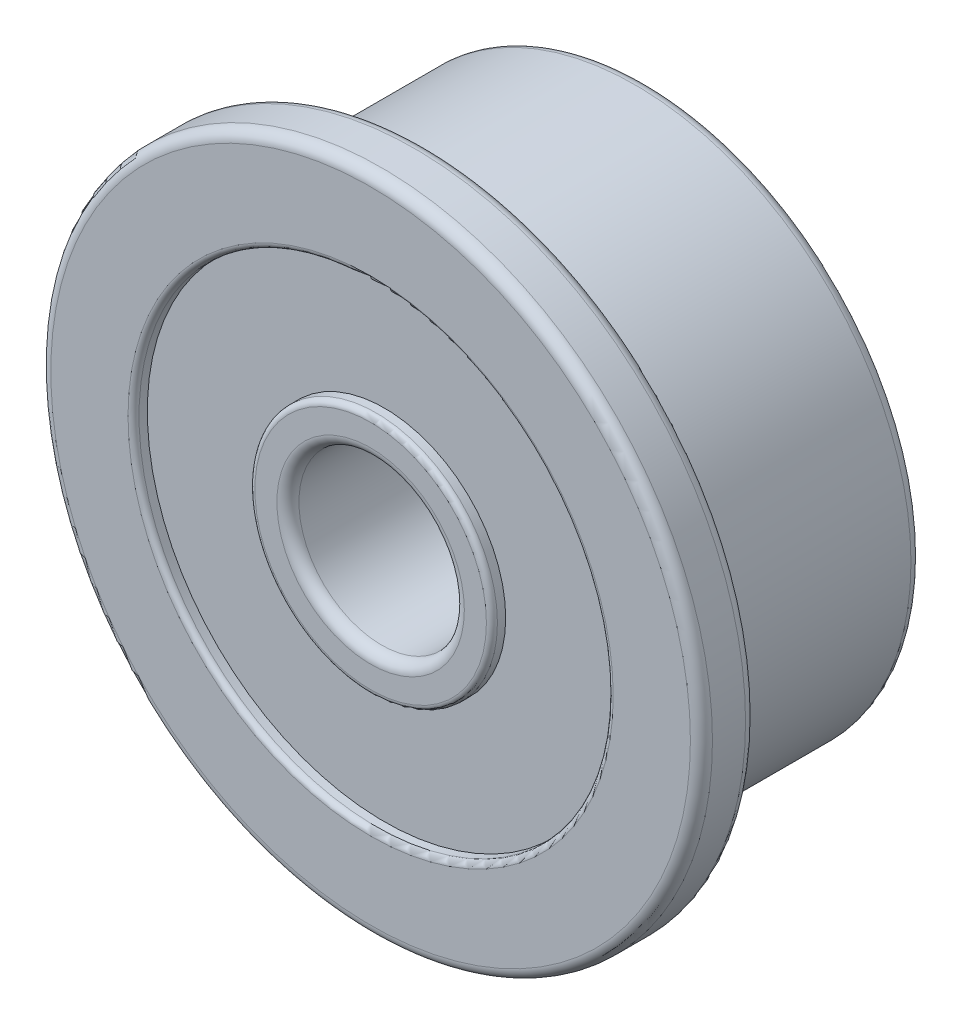
ISO-10303-21;
HEADER;
FILE_DESCRIPTION(('STEP AP214'),'2;1');
FILE_NAME('part.step','',(''),(''),'','','');
FILE_SCHEMA(('AUTOMOTIVE_DESIGN { 1 0 10303 214 1 1 1 1 }'));
ENDSEC;
DATA;
#1=APPLICATION_CONTEXT('core data for automotive mechanical design processes');
#2=APPLICATION_PROTOCOL_DEFINITION('international standard','automotive_design',2000,#1);
#3=PRODUCT_CONTEXT('',#1,'mechanical');
#4=PRODUCT('Part','Part','',(#3));
#5=PRODUCT_RELATED_PRODUCT_CATEGORY('part','',(#4));
#6=PRODUCT_DEFINITION_FORMATION('','',#4);
#7=PRODUCT_DEFINITION_CONTEXT('part definition',#1,'design');
#8=PRODUCT_DEFINITION('design','',#6,#7);
#9=PRODUCT_DEFINITION_SHAPE('','',#8);
#10=(LENGTH_UNIT() NAMED_UNIT(*) SI_UNIT(.MILLI.,.METRE.));
#11=(NAMED_UNIT(*) PLANE_ANGLE_UNIT() SI_UNIT($,.RADIAN.));
#12=(NAMED_UNIT(*) SI_UNIT($,.STERADIAN.) SOLID_ANGLE_UNIT());
#13=UNCERTAINTY_MEASURE_WITH_UNIT(LENGTH_MEASURE(1.E-05),#10,'distance_accuracy_value','');
#14=(GEOMETRIC_REPRESENTATION_CONTEXT(3) GLOBAL_UNCERTAINTY_ASSIGNED_CONTEXT((#13)) GLOBAL_UNIT_ASSIGNED_CONTEXT((#10,
#11,#12)) REPRESENTATION_CONTEXT('',''));
#15=CARTESIAN_POINT('',(0.,0.,0.));
#16=DIRECTION('',(0.,0.,1.));
#17=DIRECTION('',(1.,0.,0.));
#18=AXIS2_PLACEMENT_3D('',#15,#16,#17);
#19=CARTESIAN_POINT('',(0.,0.,5.));
#20=DIRECTION('',(0.,0.,1.));
#21=DIRECTION('',(1.,0.,0.));
#22=AXIS2_PLACEMENT_3D('',#19,#20,#21);
#23=PLANE('',#22);
#24=CARTESIAN_POINT('',(0.,0.,5.));
#25=DIRECTION('',(0.,0.,1.));
#26=DIRECTION('',(1.,0.,0.));
#27=AXIS2_PLACEMENT_3D('',#24,#25,#26);
#28=CIRCLE('',#27,2.1);
#29=CARTESIAN_POINT('',(2.1,0.,5.));
#30=VERTEX_POINT('',#29);
#31=EDGE_CURVE('E50',#30,#30,#28,.T.);
#32=ORIENTED_EDGE('',*,*,#31,.T.);
#33=EDGE_LOOP('',(#32));
#34=FACE_BOUND('',#33,.T.);
#35=CARTESIAN_POINT('',(0.,0.,5.));
#36=DIRECTION('',(0.,0.,1.));
#37=DIRECTION('',(1.,0.,0.));
#38=AXIS2_PLACEMENT_3D('',#35,#36,#37);
#39=CIRCLE('',#38,1.7);
#40=CARTESIAN_POINT('',(1.7,0.,5.));
#41=VERTEX_POINT('',#40);
#42=EDGE_CURVE('E85',#41,#41,#39,.F.);
#43=ORIENTED_EDGE('',*,*,#42,.T.);
#44=EDGE_LOOP('',(#43));
#45=FACE_BOUND('',#44,.T.);
#46=ADVANCED_FACE('F35',(#34,#45),#23,.T.);
#47=CARTESIAN_POINT('',(0.,0.,0.));
#48=DIRECTION('',(0.,0.,1.));
#49=DIRECTION('',(1.,0.,0.));
#50=AXIS2_PLACEMENT_3D('',#47,#48,#49);
#51=PLANE('',#50);
#52=CARTESIAN_POINT('',(0.,0.,0.));
#53=DIRECTION('',(0.,0.,1.));
#54=DIRECTION('',(1.,0.,0.));
#55=AXIS2_PLACEMENT_3D('',#52,#53,#54);
#56=CIRCLE('',#55,2.1);
#57=CARTESIAN_POINT('',(2.1,0.,0.));
#58=VERTEX_POINT('',#57);
#59=EDGE_CURVE('E58',#58,#58,#56,.F.);
#60=ORIENTED_EDGE('',*,*,#59,.T.);
#61=EDGE_LOOP('',(#60));
#62=FACE_BOUND('',#61,.T.);
#63=CARTESIAN_POINT('',(0.,0.,0.));
#64=DIRECTION('',(0.,0.,1.));
#65=DIRECTION('',(1.,0.,0.));
#66=AXIS2_PLACEMENT_3D('',#63,#64,#65);
#67=CIRCLE('',#66,1.7);
#68=CARTESIAN_POINT('',(1.7,0.,0.));
#69=VERTEX_POINT('',#68);
#70=EDGE_CURVE('E79',#69,#69,#67,.T.);
#71=ORIENTED_EDGE('',*,*,#70,.T.);
#72=EDGE_LOOP('',(#71));
#73=FACE_BOUND('',#72,.T.);
#74=ADVANCED_FACE('F135',(#62,#73),#51,.F.);
#75=CARTESIAN_POINT('',(0.,0.,0.));
#76=DIRECTION('',(0.,0.,1.));
#77=DIRECTION('',(1.,0.,0.));
#78=AXIS2_PLACEMENT_3D('',#75,#76,#77);
#79=CIRCLE('',#78,4.4);
#80=CARTESIAN_POINT('',(4.4,0.,0.));
#81=VERTEX_POINT('',#80);
#82=EDGE_CURVE('E61',#81,#81,#79,.T.);
#83=ORIENTED_EDGE('',*,*,#82,.T.);
#84=EDGE_LOOP('',(#83));
#85=FACE_BOUND('',#84,.T.);
#86=CARTESIAN_POINT('',(0.,0.,0.));
#87=DIRECTION('',(0.,0.,1.));
#88=DIRECTION('',(1.,0.,0.));
#89=AXIS2_PLACEMENT_3D('',#86,#87,#88);
#90=CIRCLE('',#89,4.8);
#91=CARTESIAN_POINT('',(4.8,0.,0.));
#92=VERTEX_POINT('',#91);
#93=EDGE_CURVE('E82',#92,#92,#90,.F.);
#94=ORIENTED_EDGE('',*,*,#93,.T.);
#95=EDGE_LOOP('',(#94));
#96=FACE_BOUND('',#95,.T.);
#97=ADVANCED_FACE('F142',(#85,#96),#51,.F.);
#98=CARTESIAN_POINT('',(0.,0.,4.));
#99=DIRECTION('',(0.,0.,-1.));
#100=DIRECTION('',(-1.,0.,0.));
#101=AXIS2_PLACEMENT_3D('',#98,#99,#100);
#102=CYLINDRICAL_SURFACE('',#101,5.);
#103=CARTESIAN_POINT('',(0.,0.,0.2));
#104=DIRECTION('',(0.,0.,1.));
#105=DIRECTION('',(1.,0.,0.));
#106=AXIS2_PLACEMENT_3D('',#103,#104,#105);
#107=CIRCLE('',#106,5.);
#108=CARTESIAN_POINT('',(5.,0.,0.2));
#109=VERTEX_POINT('',#108);
#110=EDGE_CURVE('E76',#109,#109,#107,.T.);
#111=ORIENTED_EDGE('',*,*,#110,.T.);
#112=EDGE_LOOP('',(#111));
#113=FACE_BOUND('',#112,.T.);
#114=CARTESIAN_POINT('',(0.,0.,4.));
#115=DIRECTION('',(0.,0.,1.));
#116=DIRECTION('',(1.,0.,0.));
#117=AXIS2_PLACEMENT_3D('',#114,#115,#116);
#118=CIRCLE('',#117,5.);
#119=CARTESIAN_POINT('',(5.,0.,4.));
#120=VERTEX_POINT('',#119);
#121=EDGE_CURVE('E99',#120,#120,#118,.T.);
#122=ORIENTED_EDGE('',*,*,#121,.F.);
#123=EDGE_LOOP('',(#122));
#124=FACE_BOUND('',#123,.T.);
#125=ADVANCED_FACE('F319',(#113,#124),#102,.T.);
#126=CARTESIAN_POINT('',(0.,0.,4.));
#127=DIRECTION('',(0.,0.,-1.));
#128=DIRECTION('',(-1.,0.,0.));
#129=AXIS2_PLACEMENT_3D('',#126,#127,#128);
#130=CYLINDRICAL_SURFACE('',#129,1.5);
#131=CARTESIAN_POINT('',(0.,0.,4.8));
#132=DIRECTION('',(0.,0.,1.));
#133=DIRECTION('',(1.,0.,0.));
#134=AXIS2_PLACEMENT_3D('',#131,#132,#133);
#135=CIRCLE('',#134,1.5);
#136=CARTESIAN_POINT('',(1.5,0.,4.8));
#137=VERTEX_POINT('',#136);
#138=EDGE_CURVE('E92',#137,#137,#135,.T.);
#139=ORIENTED_EDGE('',*,*,#138,.T.);
#140=EDGE_LOOP('',(#139));
#141=FACE_BOUND('',#140,.T.);
#142=CARTESIAN_POINT('',(0.,0.,0.2));
#143=DIRECTION('',(0.,0.,1.));
#144=DIRECTION('',(1.,0.,0.));
#145=AXIS2_PLACEMENT_3D('',#142,#143,#144);
#146=CIRCLE('',#145,1.5);
#147=CARTESIAN_POINT('',(1.5,0.,0.2));
#148=VERTEX_POINT('',#147);
#149=EDGE_CURVE('E96',#148,#148,#146,.F.);
#150=ORIENTED_EDGE('',*,*,#149,.T.);
#151=EDGE_LOOP('',(#150));
#152=FACE_BOUND('',#151,.T.);
#153=ADVANCED_FACE('F158',(#141,#152),#130,.F.);
#154=CARTESIAN_POINT('',(0.,0.,4.));
#155=DIRECTION('',(0.,0.,1.));
#156=DIRECTION('',(1.,0.,0.));
#157=AXIS2_PLACEMENT_3D('',#154,#155,#156);
#158=PLANE('',#157);
#159=CARTESIAN_POINT('',(0.,0.,4.));
#160=DIRECTION('',(0.,0.,1.));
#161=DIRECTION('',(1.,0.,0.));
#162=AXIS2_PLACEMENT_3D('',#159,#160,#161);
#163=CIRCLE('',#162,5.8);
#164=CARTESIAN_POINT('',(5.8,0.,4.));
#165=VERTEX_POINT('',#164);
#166=EDGE_CURVE('E67',#165,#165,#163,.F.);
#167=ORIENTED_EDGE('',*,*,#166,.T.);
#168=EDGE_LOOP('',(#167));
#169=FACE_BOUND('',#168,.T.);
#170=ORIENTED_EDGE('',*,*,#121,.T.);
#171=EDGE_LOOP('',(#170));
#172=FACE_BOUND('',#171,.T.);
#173=ADVANCED_FACE('F150',(#169,#172),#158,.F.);
#174=CARTESIAN_POINT('',(0.,0.,5.));
#175=DIRECTION('',(0.,0.,1.));
#176=DIRECTION('',(1.,0.,0.));
#177=AXIS2_PLACEMENT_3D('',#174,#175,#176);
#178=CIRCLE('',#177,4.4);
#179=CARTESIAN_POINT('',(4.4,0.,5.));
#180=VERTEX_POINT('',#179);
#181=EDGE_CURVE('E10',#180,#180,#178,.F.);
#182=ORIENTED_EDGE('',*,*,#181,.T.);
#183=EDGE_LOOP('',(#182));
#184=FACE_BOUND('',#183,.T.);
#185=CARTESIAN_POINT('',(0.,0.,5.));
#186=DIRECTION('',(0.,0.,1.));
#187=DIRECTION('',(1.,0.,0.));
#188=AXIS2_PLACEMENT_3D('',#185,#186,#187);
#189=CIRCLE('',#188,5.8);
#190=CARTESIAN_POINT('',(5.8,0.,5.));
#191=VERTEX_POINT('',#190);
#192=EDGE_CURVE('E89',#191,#191,#189,.T.);
#193=ORIENTED_EDGE('',*,*,#192,.T.);
#194=EDGE_LOOP('',(#193));
#195=FACE_BOUND('',#194,.T.);
#196=ADVANCED_FACE('F138',(#184,#195),#23,.T.);
#197=CARTESIAN_POINT('',(0.,0.,5.));
#198=DIRECTION('',(0.,0.,-1.));
#199=DIRECTION('',(-1.,0.,0.));
#200=AXIS2_PLACEMENT_3D('',#197,#198,#199);
#201=CYLINDRICAL_SURFACE('',#200,6.);
#202=CARTESIAN_POINT('',(0.,0.,4.8));
#203=DIRECTION('',(0.,0.,1.));
#204=DIRECTION('',(1.,0.,0.));
#205=AXIS2_PLACEMENT_3D('',#202,#203,#204);
#206=CIRCLE('',#205,6.);
#207=CARTESIAN_POINT('',(6.,0.,4.8));
#208=VERTEX_POINT('',#207);
#209=EDGE_CURVE('E70',#208,#208,#206,.F.);
#210=ORIENTED_EDGE('',*,*,#209,.T.);
#211=EDGE_LOOP('',(#210));
#212=FACE_BOUND('',#211,.T.);
#213=CARTESIAN_POINT('',(0.,0.,4.2));
#214=DIRECTION('',(0.,0.,1.));
#215=DIRECTION('',(1.,0.,0.));
#216=AXIS2_PLACEMENT_3D('',#213,#214,#215);
#217=CIRCLE('',#216,6.);
#218=CARTESIAN_POINT('',(6.,0.,4.2));
#219=VERTEX_POINT('',#218);
#220=EDGE_CURVE('E73',#219,#219,#217,.T.);
#221=ORIENTED_EDGE('',*,*,#220,.T.);
#222=EDGE_LOOP('',(#221));
#223=FACE_BOUND('',#222,.T.);
#224=ADVANCED_FACE('F149',(#212,#223),#201,.T.);
#225=CARTESIAN_POINT('',(0.,0.,4.8));
#226=DIRECTION('',(0.,0.,1.));
#227=DIRECTION('',(1.,0.,0.));
#228=AXIS2_PLACEMENT_3D('',#225,#226,#227);
#229=TOROIDAL_SURFACE('',#228,1.7,0.2);
#230=ORIENTED_EDGE('',*,*,#42,.F.);
#231=EDGE_LOOP('',(#230));
#232=FACE_BOUND('',#231,.T.);
#233=ORIENTED_EDGE('',*,*,#138,.F.);
#234=EDGE_LOOP('',(#233));
#235=FACE_BOUND('',#234,.T.);
#236=ADVANCED_FACE('F155',(#232,#235),#229,.T.);
#237=CARTESIAN_POINT('',(0.,0.,0.2));
#238=DIRECTION('',(0.,0.,1.));
#239=DIRECTION('',(1.,0.,0.));
#240=AXIS2_PLACEMENT_3D('',#237,#238,#239);
#241=TOROIDAL_SURFACE('',#240,1.7,0.2);
#242=ORIENTED_EDGE('',*,*,#149,.F.);
#243=EDGE_LOOP('',(#242));
#244=FACE_BOUND('',#243,.T.);
#245=ORIENTED_EDGE('',*,*,#70,.F.);
#246=EDGE_LOOP('',(#245));
#247=FACE_BOUND('',#246,.T.);
#248=ADVANCED_FACE('F176',(#244,#247),#241,.T.);
#249=CARTESIAN_POINT('',(0.,0.,0.2));
#250=DIRECTION('',(0.,0.,1.));
#251=DIRECTION('',(1.,0.,0.));
#252=AXIS2_PLACEMENT_3D('',#249,#250,#251);
#253=TOROIDAL_SURFACE('',#252,4.8,0.2);
#254=ORIENTED_EDGE('',*,*,#93,.F.);
#255=EDGE_LOOP('',(#254));
#256=FACE_BOUND('',#255,.T.);
#257=ORIENTED_EDGE('',*,*,#110,.F.);
#258=EDGE_LOOP('',(#257));
#259=FACE_BOUND('',#258,.T.);
#260=ADVANCED_FACE('F166',(#256,#259),#253,.T.);
#261=CARTESIAN_POINT('',(0.,0.,4.8));
#262=DIRECTION('',(0.,0.,1.));
#263=DIRECTION('',(1.,0.,0.));
#264=AXIS2_PLACEMENT_3D('',#261,#262,#263);
#265=TOROIDAL_SURFACE('',#264,5.8,0.2);
#266=ORIENTED_EDGE('',*,*,#209,.F.);
#267=EDGE_LOOP('',(#266));
#268=FACE_BOUND('',#267,.T.);
#269=ORIENTED_EDGE('',*,*,#192,.F.);
#270=EDGE_LOOP('',(#269));
#271=FACE_BOUND('',#270,.T.);
#272=ADVANCED_FACE('F163',(#268,#271),#265,.T.);
#273=CARTESIAN_POINT('',(0.,0.,4.2));
#274=DIRECTION('',(0.,0.,1.));
#275=DIRECTION('',(1.,0.,0.));
#276=AXIS2_PLACEMENT_3D('',#273,#274,#275);
#277=TOROIDAL_SURFACE('',#276,5.8,0.2);
#278=ORIENTED_EDGE('',*,*,#166,.F.);
#279=EDGE_LOOP('',(#278));
#280=FACE_BOUND('',#279,.T.);
#281=ORIENTED_EDGE('',*,*,#220,.F.);
#282=EDGE_LOOP('',(#281));
#283=FACE_BOUND('',#282,.T.);
#284=ADVANCED_FACE('F165',(#280,#283),#277,.T.);
#285=CARTESIAN_POINT('',(0.,0.,0.25));
#286=DIRECTION('',(0.,0.,-1.));
#287=DIRECTION('',(-1.,0.,0.));
#288=AXIS2_PLACEMENT_3D('',#285,#286,#287);
#289=CYLINDRICAL_SURFACE('',#288,4.3);
#290=CARTESIAN_POINT('',(0.,0.,0.1));
#291=DIRECTION('',(0.,0.,1.));
#292=DIRECTION('',(1.,0.,0.));
#293=AXIS2_PLACEMENT_3D('',#290,#291,#292);
#294=CIRCLE('',#293,4.3);
#295=CARTESIAN_POINT('',(4.3,0.,0.1));
#296=VERTEX_POINT('',#295);
#297=EDGE_CURVE('E64',#296,#296,#294,.F.);
#298=ORIENTED_EDGE('',*,*,#297,.T.);
#299=EDGE_LOOP('',(#298));
#300=FACE_BOUND('',#299,.T.);
#301=CARTESIAN_POINT('',(0.,0.,0.25));
#302=DIRECTION('',(0.,0.,-1.));
#303=DIRECTION('',(-1.,0.,0.));
#304=AXIS2_PLACEMENT_3D('',#301,#302,#303);
#305=CIRCLE('',#304,4.3);
#306=CARTESIAN_POINT('',(-4.3,0.,0.25));
#307=VERTEX_POINT('',#306);
#308=EDGE_CURVE('E102',#307,#307,#305,.T.);
#309=ORIENTED_EDGE('',*,*,#308,.F.);
#310=EDGE_LOOP('',(#309));
#311=FACE_BOUND('',#310,.T.);
#312=ADVANCED_FACE('F173',(#300,#311),#289,.F.);
#313=CARTESIAN_POINT('',(0.,0.,0.25));
#314=DIRECTION('',(0.,0.,-1.));
#315=DIRECTION('',(-1.,0.,0.));
#316=AXIS2_PLACEMENT_3D('',#313,#314,#315);
#317=PLANE('',#316);
#318=CARTESIAN_POINT('',(0.,0.,0.25));
#319=DIRECTION('',(0.,0.,-1.));
#320=DIRECTION('',(-1.,0.,0.));
#321=AXIS2_PLACEMENT_3D('',#318,#319,#320);
#322=CIRCLE('',#321,2.2);
#323=CARTESIAN_POINT('',(-2.2,0.,0.25));
#324=VERTEX_POINT('',#323);
#325=EDGE_CURVE('E105',#324,#324,#322,.T.);
#326=ORIENTED_EDGE('',*,*,#325,.F.);
#327=EDGE_LOOP('',(#326));
#328=FACE_BOUND('',#327,.T.);
#329=ORIENTED_EDGE('',*,*,#308,.T.);
#330=EDGE_LOOP('',(#329));
#331=FACE_BOUND('',#330,.T.);
#332=ADVANCED_FACE('F131',(#328,#331),#317,.T.);
#333=CARTESIAN_POINT('',(0.,0.,0.25));
#334=DIRECTION('',(0.,0.,-1.));
#335=DIRECTION('',(-1.,0.,0.));
#336=AXIS2_PLACEMENT_3D('',#333,#334,#335);
#337=CYLINDRICAL_SURFACE('',#336,2.2);
#338=CARTESIAN_POINT('',(0.,0.,0.1));
#339=DIRECTION('',(0.,0.,1.));
#340=DIRECTION('',(1.,0.,0.));
#341=AXIS2_PLACEMENT_3D('',#338,#339,#340);
#342=CIRCLE('',#341,2.2);
#343=CARTESIAN_POINT('',(2.2,0.,0.1));
#344=VERTEX_POINT('',#343);
#345=EDGE_CURVE('E55',#344,#344,#342,.T.);
#346=ORIENTED_EDGE('',*,*,#345,.T.);
#347=EDGE_LOOP('',(#346));
#348=FACE_BOUND('',#347,.T.);
#349=ORIENTED_EDGE('',*,*,#325,.T.);
#350=EDGE_LOOP('',(#349));
#351=FACE_BOUND('',#350,.T.);
#352=ADVANCED_FACE('F126',(#348,#351),#337,.T.);
#353=CARTESIAN_POINT('',(0.,0.,4.75));
#354=DIRECTION('',(0.,0.,1.));
#355=DIRECTION('',(1.,0.,0.));
#356=AXIS2_PLACEMENT_3D('',#353,#354,#355);
#357=CYLINDRICAL_SURFACE('',#356,4.3);
#358=CARTESIAN_POINT('',(0.,0.,4.9));
#359=DIRECTION('',(0.,0.,1.));
#360=DIRECTION('',(1.,0.,0.));
#361=AXIS2_PLACEMENT_3D('',#358,#359,#360);
#362=CIRCLE('',#361,4.3);
#363=CARTESIAN_POINT('',(4.3,0.,4.9));
#364=VERTEX_POINT('',#363);
#365=EDGE_CURVE('E42',#364,#364,#362,.T.);
#366=ORIENTED_EDGE('',*,*,#365,.T.);
#367=EDGE_LOOP('',(#366));
#368=FACE_BOUND('',#367,.T.);
#369=CARTESIAN_POINT('',(0.,0.,4.75));
#370=DIRECTION('',(0.,0.,1.));
#371=DIRECTION('',(1.,0.,0.));
#372=AXIS2_PLACEMENT_3D('',#369,#370,#371);
#373=CIRCLE('',#372,4.3);
#374=CARTESIAN_POINT('',(4.3,0.,4.75));
#375=VERTEX_POINT('',#374);
#376=EDGE_CURVE('E108',#375,#375,#373,.T.);
#377=ORIENTED_EDGE('',*,*,#376,.F.);
#378=EDGE_LOOP('',(#377));
#379=FACE_BOUND('',#378,.T.);
#380=ADVANCED_FACE('F121',(#368,#379),#357,.F.);
#381=CARTESIAN_POINT('',(0.,0.,4.75));
#382=DIRECTION('',(0.,0.,1.));
#383=DIRECTION('',(1.,0.,0.));
#384=AXIS2_PLACEMENT_3D('',#381,#382,#383);
#385=PLANE('',#384);
#386=CARTESIAN_POINT('',(0.,0.,4.75));
#387=DIRECTION('',(0.,0.,1.));
#388=DIRECTION('',(1.,0.,0.));
#389=AXIS2_PLACEMENT_3D('',#386,#387,#388);
#390=CIRCLE('',#389,2.2);
#391=CARTESIAN_POINT('',(2.2,0.,4.75));
#392=VERTEX_POINT('',#391);
#393=EDGE_CURVE('E111',#392,#392,#390,.T.);
#394=ORIENTED_EDGE('',*,*,#393,.F.);
#395=EDGE_LOOP('',(#394));
#396=FACE_BOUND('',#395,.T.);
#397=ORIENTED_EDGE('',*,*,#376,.T.);
#398=EDGE_LOOP('',(#397));
#399=FACE_BOUND('',#398,.T.);
#400=ADVANCED_FACE('F118',(#396,#399),#385,.T.);
#401=CARTESIAN_POINT('',(0.,0.,4.75));
#402=DIRECTION('',(0.,0.,1.));
#403=DIRECTION('',(1.,0.,0.));
#404=AXIS2_PLACEMENT_3D('',#401,#402,#403);
#405=CYLINDRICAL_SURFACE('',#404,2.2);
#406=CARTESIAN_POINT('',(0.,0.,4.9));
#407=DIRECTION('',(0.,0.,1.));
#408=DIRECTION('',(1.,0.,0.));
#409=AXIS2_PLACEMENT_3D('',#406,#407,#408);
#410=CIRCLE('',#409,2.2);
#411=CARTESIAN_POINT('',(2.2,0.,4.9));
#412=VERTEX_POINT('',#411);
#413=EDGE_CURVE('E46',#412,#412,#410,.F.);
#414=ORIENTED_EDGE('',*,*,#413,.T.);
#415=EDGE_LOOP('',(#414));
#416=FACE_BOUND('',#415,.T.);
#417=ORIENTED_EDGE('',*,*,#393,.T.);
#418=EDGE_LOOP('',(#417));
#419=FACE_BOUND('',#418,.T.);
#420=ADVANCED_FACE('F116',(#416,#419),#405,.T.);
#421=CARTESIAN_POINT('',(0.,0.,0.1));
#422=DIRECTION('',(0.,0.,1.));
#423=DIRECTION('',(1.,0.,0.));
#424=AXIS2_PLACEMENT_3D('',#421,#422,#423);
#425=TOROIDAL_SURFACE('',#424,4.4,0.1);
#426=ORIENTED_EDGE('',*,*,#82,.F.);
#427=EDGE_LOOP('',(#426));
#428=FACE_BOUND('',#427,.T.);
#429=ORIENTED_EDGE('',*,*,#297,.F.);
#430=EDGE_LOOP('',(#429));
#431=FACE_BOUND('',#430,.T.);
#432=ADVANCED_FACE('F182',(#428,#431),#425,.T.);
#433=CARTESIAN_POINT('',(0.,0.,0.1));
#434=DIRECTION('',(0.,0.,1.));
#435=DIRECTION('',(1.,0.,0.));
#436=AXIS2_PLACEMENT_3D('',#433,#434,#435);
#437=TOROIDAL_SURFACE('',#436,2.1,0.1);
#438=ORIENTED_EDGE('',*,*,#345,.F.);
#439=EDGE_LOOP('',(#438));
#440=FACE_BOUND('',#439,.T.);
#441=ORIENTED_EDGE('',*,*,#59,.F.);
#442=EDGE_LOOP('',(#441));
#443=FACE_BOUND('',#442,.T.);
#444=ADVANCED_FACE('F185',(#440,#443),#437,.T.);
#445=CARTESIAN_POINT('',(0.,0.,4.9));
#446=DIRECTION('',(0.,0.,1.));
#447=DIRECTION('',(1.,0.,0.));
#448=AXIS2_PLACEMENT_3D('',#445,#446,#447);
#449=TOROIDAL_SURFACE('',#448,2.1,0.1);
#450=ORIENTED_EDGE('',*,*,#413,.F.);
#451=EDGE_LOOP('',(#450));
#452=FACE_BOUND('',#451,.T.);
#453=ORIENTED_EDGE('',*,*,#31,.F.);
#454=EDGE_LOOP('',(#453));
#455=FACE_BOUND('',#454,.T.);
#456=ADVANCED_FACE('F188',(#452,#455),#449,.T.);
#457=CARTESIAN_POINT('',(0.,0.,4.9));
#458=DIRECTION('',(0.,0.,1.));
#459=DIRECTION('',(1.,0.,0.));
#460=AXIS2_PLACEMENT_3D('',#457,#458,#459);
#461=TOROIDAL_SURFACE('',#460,4.4,0.1);
#462=ORIENTED_EDGE('',*,*,#181,.F.);
#463=EDGE_LOOP('',(#462));
#464=FACE_BOUND('',#463,.T.);
#465=ORIENTED_EDGE('',*,*,#365,.F.);
#466=EDGE_LOOP('',(#465));
#467=FACE_BOUND('',#466,.T.);
#468=ADVANCED_FACE('F37',(#464,#467),#461,.T.);
#469=CLOSED_SHELL('',(#46,#74,#97,#125,#153,#173,#196,#224,#236,#248,#260,#272,#284,#312,#332,
#352,#380,#400,#420,#432,#444,#456,#468));
#470=MANIFOLD_SOLID_BREP('B2',#469);
#471=ADVANCED_BREP_SHAPE_REPRESENTATION('',(#18,#470),#14);
#472=SHAPE_DEFINITION_REPRESENTATION(#9,#471);
ENDSEC;
END-ISO-10303-21;
